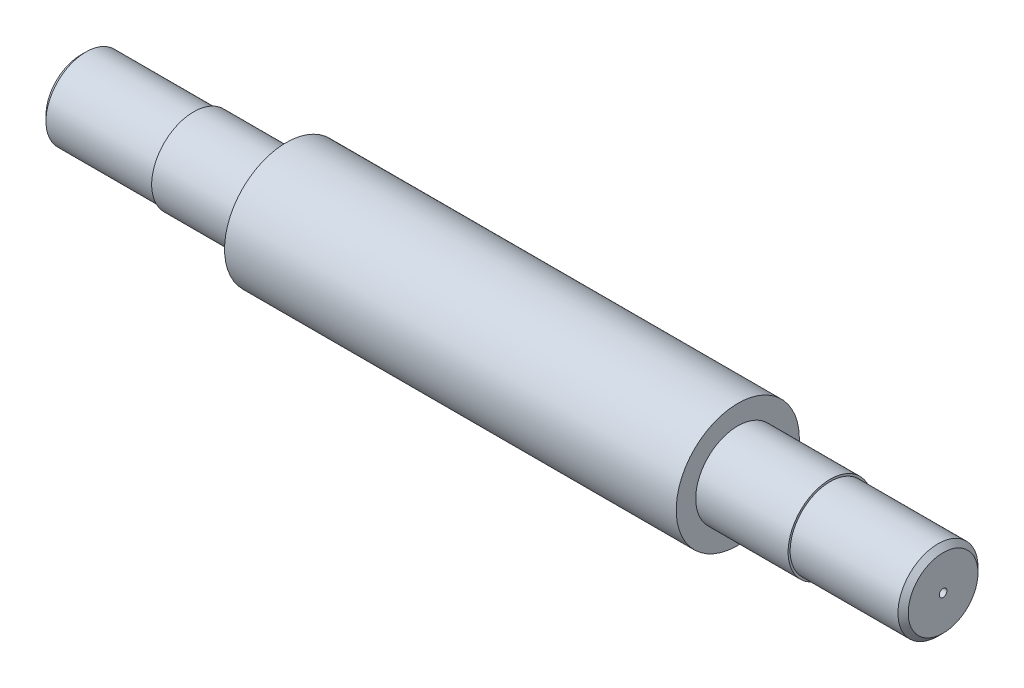
ISO-10303-21;
HEADER;
FILE_DESCRIPTION(('STEP AP214'),'2;1');
FILE_NAME('part.step','',(''),(''),'','','');
FILE_SCHEMA(('AUTOMOTIVE_DESIGN { 1 0 10303 214 1 1 1 1 }'));
ENDSEC;
DATA;
#1=APPLICATION_CONTEXT('core data for automotive mechanical design processes');
#2=APPLICATION_PROTOCOL_DEFINITION('international standard','automotive_design',2000,#1);
#3=PRODUCT_CONTEXT('',#1,'mechanical');
#4=PRODUCT('Part','Part','',(#3));
#5=PRODUCT_RELATED_PRODUCT_CATEGORY('part','',(#4));
#6=PRODUCT_DEFINITION_FORMATION('','',#4);
#7=PRODUCT_DEFINITION_CONTEXT('part definition',#1,'design');
#8=PRODUCT_DEFINITION('design','',#6,#7);
#9=PRODUCT_DEFINITION_SHAPE('','',#8);
#10=(LENGTH_UNIT() NAMED_UNIT(*) SI_UNIT(.MILLI.,.METRE.));
#11=(NAMED_UNIT(*) PLANE_ANGLE_UNIT() SI_UNIT($,.RADIAN.));
#12=(NAMED_UNIT(*) SI_UNIT($,.STERADIAN.) SOLID_ANGLE_UNIT());
#13=UNCERTAINTY_MEASURE_WITH_UNIT(LENGTH_MEASURE(1.E-05),#10,'distance_accuracy_value','');
#14=(GEOMETRIC_REPRESENTATION_CONTEXT(3) GLOBAL_UNCERTAINTY_ASSIGNED_CONTEXT((#13)) GLOBAL_UNIT_ASSIGNED_CONTEXT((#10,
#11,#12)) REPRESENTATION_CONTEXT('',''));
#15=CARTESIAN_POINT('',(0.,0.,0.));
#16=DIRECTION('',(0.,0.,1.));
#17=DIRECTION('',(1.,0.,0.));
#18=AXIS2_PLACEMENT_3D('',#15,#16,#17);
#19=CARTESIAN_POINT('',(220.,0.,0.));
#20=DIRECTION('',(-1.,0.,0.));
#21=DIRECTION('',(0.,0.,1.));
#22=AXIS2_PLACEMENT_3D('',#19,#20,#21);
#23=CYLINDRICAL_SURFACE('',#22,60.);
#24=CARTESIAN_POINT('',(220.,0.,0.));
#25=DIRECTION('',(1.,0.,0.));
#26=DIRECTION('',(0.,0.,-1.));
#27=AXIS2_PLACEMENT_3D('',#24,#25,#26);
#28=CIRCLE('',#27,60.);
#29=CARTESIAN_POINT('',(220.,0.,-60.));
#30=VERTEX_POINT('',#29);
#31=EDGE_CURVE('E79',#30,#30,#28,.T.);
#32=ORIENTED_EDGE('',*,*,#31,.F.);
#33=EDGE_LOOP('',(#32));
#34=FACE_BOUND('',#33,.T.);
#35=CARTESIAN_POINT('',(-220.,0.,0.));
#36=DIRECTION('',(1.,0.,0.));
#37=DIRECTION('',(0.,0.,-1.));
#38=AXIS2_PLACEMENT_3D('',#35,#36,#37);
#39=CIRCLE('',#38,60.);
#40=CARTESIAN_POINT('',(-220.,0.,-60.));
#41=VERTEX_POINT('',#40);
#42=EDGE_CURVE('E80',#41,#41,#39,.T.);
#43=ORIENTED_EDGE('',*,*,#42,.T.);
#44=EDGE_LOOP('',(#43));
#45=FACE_BOUND('',#44,.T.);
#46=ADVANCED_FACE('F43',(#34,#45),#23,.T.);
#47=CARTESIAN_POINT('',(220.,0.,0.));
#48=DIRECTION('',(1.,0.,0.));
#49=DIRECTION('',(0.,0.,-1.));
#50=AXIS2_PLACEMENT_3D('',#47,#48,#49);
#51=PLANE('',#50);
#52=CARTESIAN_POINT('',(220.,0.,0.));
#53=DIRECTION('',(1.,0.,0.));
#54=DIRECTION('',(0.,0.,-1.));
#55=AXIS2_PLACEMENT_3D('',#52,#53,#54);
#56=CIRCLE('',#55,41.);
#57=CARTESIAN_POINT('',(220.,0.,-41.));
#58=VERTEX_POINT('',#57);
#59=EDGE_CURVE('E84',#58,#58,#56,.F.);
#60=ORIENTED_EDGE('',*,*,#59,.T.);
#61=EDGE_LOOP('',(#60));
#62=FACE_BOUND('',#61,.T.);
#63=ORIENTED_EDGE('',*,*,#31,.T.);
#64=EDGE_LOOP('',(#63));
#65=FACE_BOUND('',#64,.T.);
#66=ADVANCED_FACE('F143',(#62,#65),#51,.T.);
#67=CARTESIAN_POINT('',(-220.,0.,0.));
#68=DIRECTION('',(1.,0.,0.));
#69=DIRECTION('',(0.,0.,-1.));
#70=AXIS2_PLACEMENT_3D('',#67,#68,#69);
#71=PLANE('',#70);
#72=CARTESIAN_POINT('',(-220.,0.,0.));
#73=DIRECTION('',(1.,0.,0.));
#74=DIRECTION('',(0.,0.,-1.));
#75=AXIS2_PLACEMENT_3D('',#72,#73,#74);
#76=CIRCLE('',#75,41.);
#77=CARTESIAN_POINT('',(-220.,0.,-41.));
#78=VERTEX_POINT('',#77);
#79=EDGE_CURVE('E75',#78,#78,#76,.F.);
#80=ORIENTED_EDGE('',*,*,#79,.F.);
#81=EDGE_LOOP('',(#80));
#82=FACE_BOUND('',#81,.T.);
#83=ORIENTED_EDGE('',*,*,#42,.F.);
#84=EDGE_LOOP('',(#83));
#85=FACE_BOUND('',#84,.T.);
#86=ADVANCED_FACE('F149',(#82,#85),#71,.F.);
#87=CARTESIAN_POINT('',(-310.,0.,0.));
#88=DIRECTION('',(1.,0.,0.));
#89=DIRECTION('',(0.,0.,-1.));
#90=AXIS2_PLACEMENT_3D('',#87,#88,#89);
#91=PLANE('',#90);
#92=CARTESIAN_POINT('',(-310.,0.,0.));
#93=DIRECTION('',(1.,0.,0.));
#94=DIRECTION('',(0.,0.,-1.));
#95=AXIS2_PLACEMENT_3D('',#92,#93,#94);
#96=CIRCLE('',#95,39.);
#97=CARTESIAN_POINT('',(-310.,0.,-39.));
#98=VERTEX_POINT('',#97);
#99=EDGE_CURVE('E68',#98,#98,#96,.F.);
#100=ORIENTED_EDGE('',*,*,#99,.F.);
#101=EDGE_LOOP('',(#100));
#102=FACE_BOUND('',#101,.T.);
#103=CARTESIAN_POINT('',(-310.,0.,0.));
#104=DIRECTION('',(1.,0.,0.));
#105=DIRECTION('',(0.,0.,-1.));
#106=AXIS2_PLACEMENT_3D('',#103,#104,#105);
#107=CIRCLE('',#106,41.);
#108=CARTESIAN_POINT('',(-310.,0.,-41.));
#109=VERTEX_POINT('',#108);
#110=EDGE_CURVE('E73',#109,#109,#107,.T.);
#111=ORIENTED_EDGE('',*,*,#110,.F.);
#112=EDGE_LOOP('',(#111));
#113=FACE_BOUND('',#112,.T.);
#114=ADVANCED_FACE('F173',(#102,#113),#91,.F.);
#115=CARTESIAN_POINT('',(310.,0.,0.));
#116=DIRECTION('',(-1.,0.,0.));
#117=DIRECTION('',(0.,0.,1.));
#118=AXIS2_PLACEMENT_3D('',#115,#116,#117);
#119=CYLINDRICAL_SURFACE('',#118,41.);
#120=ORIENTED_EDGE('',*,*,#110,.T.);
#121=EDGE_LOOP('',(#120));
#122=FACE_BOUND('',#121,.T.);
#123=ORIENTED_EDGE('',*,*,#79,.T.);
#124=EDGE_LOOP('',(#123));
#125=FACE_BOUND('',#124,.T.);
#126=ADVANCED_FACE('F176',(#122,#125),#119,.T.);
#127=ORIENTED_EDGE('',*,*,#59,.F.);
#128=EDGE_LOOP('',(#127));
#129=FACE_BOUND('',#128,.T.);
#130=CARTESIAN_POINT('',(310.,0.,0.));
#131=DIRECTION('',(1.,0.,0.));
#132=DIRECTION('',(0.,0.,-1.));
#133=AXIS2_PLACEMENT_3D('',#130,#131,#132);
#134=CIRCLE('',#133,41.);
#135=CARTESIAN_POINT('',(310.,0.,-41.));
#136=VERTEX_POINT('',#135);
#137=EDGE_CURVE('E91',#136,#136,#134,.T.);
#138=ORIENTED_EDGE('',*,*,#137,.F.);
#139=EDGE_LOOP('',(#138));
#140=FACE_BOUND('',#139,.T.);
#141=ADVANCED_FACE('F182',(#129,#140),#119,.T.);
#142=CARTESIAN_POINT('',(310.,0.,0.));
#143=DIRECTION('',(1.,0.,0.));
#144=DIRECTION('',(0.,0.,-1.));
#145=AXIS2_PLACEMENT_3D('',#142,#143,#144);
#146=PLANE('',#145);
#147=CARTESIAN_POINT('',(310.,0.,0.));
#148=DIRECTION('',(1.,0.,0.));
#149=DIRECTION('',(0.,0.,-1.));
#150=AXIS2_PLACEMENT_3D('',#147,#148,#149);
#151=CIRCLE('',#150,39.);
#152=CARTESIAN_POINT('',(310.,0.,-39.));
#153=VERTEX_POINT('',#152);
#154=EDGE_CURVE('E69',#153,#153,#151,.F.);
#155=ORIENTED_EDGE('',*,*,#154,.T.);
#156=EDGE_LOOP('',(#155));
#157=FACE_BOUND('',#156,.T.);
#158=ORIENTED_EDGE('',*,*,#137,.T.);
#159=EDGE_LOOP('',(#158));
#160=FACE_BOUND('',#159,.T.);
#161=ADVANCED_FACE('F208',(#157,#160),#146,.T.);
#162=CARTESIAN_POINT('',(420.,0.,0.));
#163=DIRECTION('',(1.,0.,0.));
#164=DIRECTION('',(0.,0.,-1.));
#165=AXIS2_PLACEMENT_3D('',#162,#163,#164);
#166=PLANE('',#165);
#167=CARTESIAN_POINT('',(420.,0.,0.));
#168=DIRECTION('',(1.,0.,0.));
#169=DIRECTION('',(0.,0.,-1.));
#170=AXIS2_PLACEMENT_3D('',#167,#168,#169);
#171=CIRCLE('',#170,34.);
#172=CARTESIAN_POINT('',(420.,0.,-34.));
#173=VERTEX_POINT('',#172);
#174=EDGE_CURVE('E52',#173,#173,#171,.T.);
#175=ORIENTED_EDGE('',*,*,#174,.T.);
#176=EDGE_LOOP('',(#175));
#177=FACE_BOUND('',#176,.T.);
#178=CARTESIAN_POINT('',(420.,0.,0.));
#179=DIRECTION('',(1.,0.,0.));
#180=DIRECTION('',(0.,0.,-1.));
#181=AXIS2_PLACEMENT_3D('',#178,#179,#180);
#182=CIRCLE('',#181,3.75);
#183=CARTESIAN_POINT('',(420.,0.,-3.75));
#184=VERTEX_POINT('',#183);
#185=EDGE_CURVE('E101',#184,#184,#182,.T.);
#186=ORIENTED_EDGE('',*,*,#185,.F.);
#187=EDGE_LOOP('',(#186));
#188=FACE_BOUND('',#187,.T.);
#189=ADVANCED_FACE('F214',(#177,#188),#166,.T.);
#190=CARTESIAN_POINT('',(420.,0.,0.));
#191=DIRECTION('',(-1.,0.,0.));
#192=DIRECTION('',(0.,0.,1.));
#193=AXIS2_PLACEMENT_3D('',#190,#191,#192);
#194=CYLINDRICAL_SURFACE('',#193,39.);
#195=CARTESIAN_POINT('',(415.,0.,0.));
#196=DIRECTION('',(1.,0.,0.));
#197=DIRECTION('',(0.,0.,-1.));
#198=AXIS2_PLACEMENT_3D('',#195,#196,#197);
#199=CIRCLE('',#198,39.);
#200=CARTESIAN_POINT('',(415.,0.,-39.));
#201=VERTEX_POINT('',#200);
#202=EDGE_CURVE('E10',#201,#201,#199,.F.);
#203=ORIENTED_EDGE('',*,*,#202,.T.);
#204=EDGE_LOOP('',(#203));
#205=FACE_BOUND('',#204,.T.);
#206=ORIENTED_EDGE('',*,*,#154,.F.);
#207=EDGE_LOOP('',(#206));
#208=FACE_BOUND('',#207,.T.);
#209=ADVANCED_FACE('F138',(#205,#208),#194,.T.);
#210=CARTESIAN_POINT('',(-415.,0.,0.));
#211=DIRECTION('',(1.,0.,0.));
#212=DIRECTION('',(0.,0.,-1.));
#213=AXIS2_PLACEMENT_3D('',#210,#211,#212);
#214=CIRCLE('',#213,39.);
#215=CARTESIAN_POINT('',(-415.,0.,-39.));
#216=VERTEX_POINT('',#215);
#217=EDGE_CURVE('E62',#216,#216,#214,.T.);
#218=ORIENTED_EDGE('',*,*,#217,.T.);
#219=EDGE_LOOP('',(#218));
#220=FACE_BOUND('',#219,.T.);
#221=ORIENTED_EDGE('',*,*,#99,.T.);
#222=EDGE_LOOP('',(#221));
#223=FACE_BOUND('',#222,.T.);
#224=ADVANCED_FACE('F129',(#220,#223),#194,.T.);
#225=CARTESIAN_POINT('',(-420.,0.,0.));
#226=DIRECTION('',(1.,0.,0.));
#227=DIRECTION('',(0.,0.,-1.));
#228=AXIS2_PLACEMENT_3D('',#225,#226,#227);
#229=PLANE('',#228);
#230=CARTESIAN_POINT('',(-420.,0.,0.));
#231=DIRECTION('',(1.,0.,0.));
#232=DIRECTION('',(0.,0.,-1.));
#233=AXIS2_PLACEMENT_3D('',#230,#231,#232);
#234=CIRCLE('',#233,34.);
#235=CARTESIAN_POINT('',(-420.,0.,-34.));
#236=VERTEX_POINT('',#235);
#237=EDGE_CURVE('E57',#236,#236,#234,.F.);
#238=ORIENTED_EDGE('',*,*,#237,.T.);
#239=EDGE_LOOP('',(#238));
#240=FACE_BOUND('',#239,.T.);
#241=CARTESIAN_POINT('',(-420.,0.,0.));
#242=DIRECTION('',(-1.,0.,0.));
#243=DIRECTION('',(0.,0.,1.));
#244=AXIS2_PLACEMENT_3D('',#241,#242,#243);
#245=CIRCLE('',#244,3.6);
#246=CARTESIAN_POINT('',(-420.,0.,3.6));
#247=VERTEX_POINT('',#246);
#248=EDGE_CURVE('E109',#247,#247,#245,.T.);
#249=ORIENTED_EDGE('',*,*,#248,.F.);
#250=EDGE_LOOP('',(#249));
#251=FACE_BOUND('',#250,.T.);
#252=ADVANCED_FACE('F126',(#240,#251),#229,.F.);
#253=CARTESIAN_POINT('',(413.75,0.,0.));
#254=DIRECTION('',(1.,0.,0.));
#255=DIRECTION('',(0.,0.,-1.));
#256=AXIS2_PLACEMENT_3D('',#253,#254,#255);
#257=CYLINDRICAL_SURFACE('',#256,3.75);
#258=CARTESIAN_POINT('',(413.75,0.,0.));
#259=DIRECTION('',(1.,0.,0.));
#260=DIRECTION('',(0.,0.,-1.));
#261=AXIS2_PLACEMENT_3D('',#258,#259,#260);
#262=CIRCLE('',#261,3.75);
#263=CARTESIAN_POINT('',(413.75,0.,-3.75));
#264=VERTEX_POINT('',#263);
#265=EDGE_CURVE('E74',#264,#264,#262,.T.);
#266=ORIENTED_EDGE('',*,*,#265,.F.);
#267=EDGE_LOOP('',(#266));
#268=FACE_BOUND('',#267,.T.);
#269=ORIENTED_EDGE('',*,*,#185,.T.);
#270=EDGE_LOOP('',(#269));
#271=FACE_BOUND('',#270,.T.);
#272=ADVANCED_FACE('F128',(#268,#271),#257,.F.);
#273=CARTESIAN_POINT('',(413.75,0.,0.));
#274=DIRECTION('',(1.,0.,0.));
#275=DIRECTION('',(0.,0.,-1.));
#276=AXIS2_PLACEMENT_3D('',#273,#274,#275);
#277=PLANE('',#276);
#278=ORIENTED_EDGE('',*,*,#265,.T.);
#279=EDGE_LOOP('',(#278));
#280=FACE_BOUND('',#279,.T.);
#281=ADVANCED_FACE('F122',(#280),#277,.T.);
#282=CARTESIAN_POINT('',(-413.75,0.,0.));
#283=DIRECTION('',(-1.,0.,0.));
#284=DIRECTION('',(0.,0.,1.));
#285=AXIS2_PLACEMENT_3D('',#282,#283,#284);
#286=CYLINDRICAL_SURFACE('',#285,3.6);
#287=CARTESIAN_POINT('',(-413.75,0.,0.));
#288=DIRECTION('',(-1.,0.,0.));
#289=DIRECTION('',(0.,0.,1.));
#290=AXIS2_PLACEMENT_3D('',#287,#288,#289);
#291=CIRCLE('',#290,3.6);
#292=CARTESIAN_POINT('',(-413.75,0.,3.6));
#293=VERTEX_POINT('',#292);
#294=EDGE_CURVE('E105',#293,#293,#291,.T.);
#295=ORIENTED_EDGE('',*,*,#294,.F.);
#296=EDGE_LOOP('',(#295));
#297=FACE_BOUND('',#296,.T.);
#298=ORIENTED_EDGE('',*,*,#248,.T.);
#299=EDGE_LOOP('',(#298));
#300=FACE_BOUND('',#299,.T.);
#301=ADVANCED_FACE('F119',(#297,#300),#286,.F.);
#302=CARTESIAN_POINT('',(-413.75,0.,0.));
#303=DIRECTION('',(-1.,0.,0.));
#304=DIRECTION('',(0.,0.,1.));
#305=AXIS2_PLACEMENT_3D('',#302,#303,#304);
#306=PLANE('',#305);
#307=ORIENTED_EDGE('',*,*,#294,.T.);
#308=EDGE_LOOP('',(#307));
#309=FACE_BOUND('',#308,.T.);
#310=ADVANCED_FACE('F117',(#309),#306,.T.);
#311=CARTESIAN_POINT('',(-415.,0.,0.));
#312=DIRECTION('',(1.,0.,0.));
#313=DIRECTION('',(0.,0.,-1.));
#314=AXIS2_PLACEMENT_3D('',#311,#312,#313);
#315=CONICAL_SURFACE('',#314,39.,0.785398163397456);
#316=ORIENTED_EDGE('',*,*,#237,.F.);
#317=EDGE_LOOP('',(#316));
#318=FACE_BOUND('',#317,.T.);
#319=ORIENTED_EDGE('',*,*,#217,.F.);
#320=EDGE_LOOP('',(#319));
#321=FACE_BOUND('',#320,.T.);
#322=ADVANCED_FACE('F156',(#318,#321),#315,.T.);
#323=CARTESIAN_POINT('',(420.,0.,0.));
#324=DIRECTION('',(-1.,0.,0.));
#325=DIRECTION('',(0.,0.,1.));
#326=AXIS2_PLACEMENT_3D('',#323,#324,#325);
#327=CONICAL_SURFACE('',#326,34.,0.78539816339745);
#328=ORIENTED_EDGE('',*,*,#202,.F.);
#329=EDGE_LOOP('',(#328));
#330=FACE_BOUND('',#329,.T.);
#331=ORIENTED_EDGE('',*,*,#174,.F.);
#332=EDGE_LOOP('',(#331));
#333=FACE_BOUND('',#332,.T.);
#334=ADVANCED_FACE('F46',(#330,#333),#327,.T.);
#335=CLOSED_SHELL('',(#46,#66,#86,#114,#126,#141,#161,#189,#209,#224,#252,#272,#281,#301,#310,
#322,#334));
#336=MANIFOLD_SOLID_BREP('B2',#335);
#337=ADVANCED_BREP_SHAPE_REPRESENTATION('',(#18,#336),#14);
#338=SHAPE_DEFINITION_REPRESENTATION(#9,#337);
ENDSEC;
END-ISO-10303-21;
